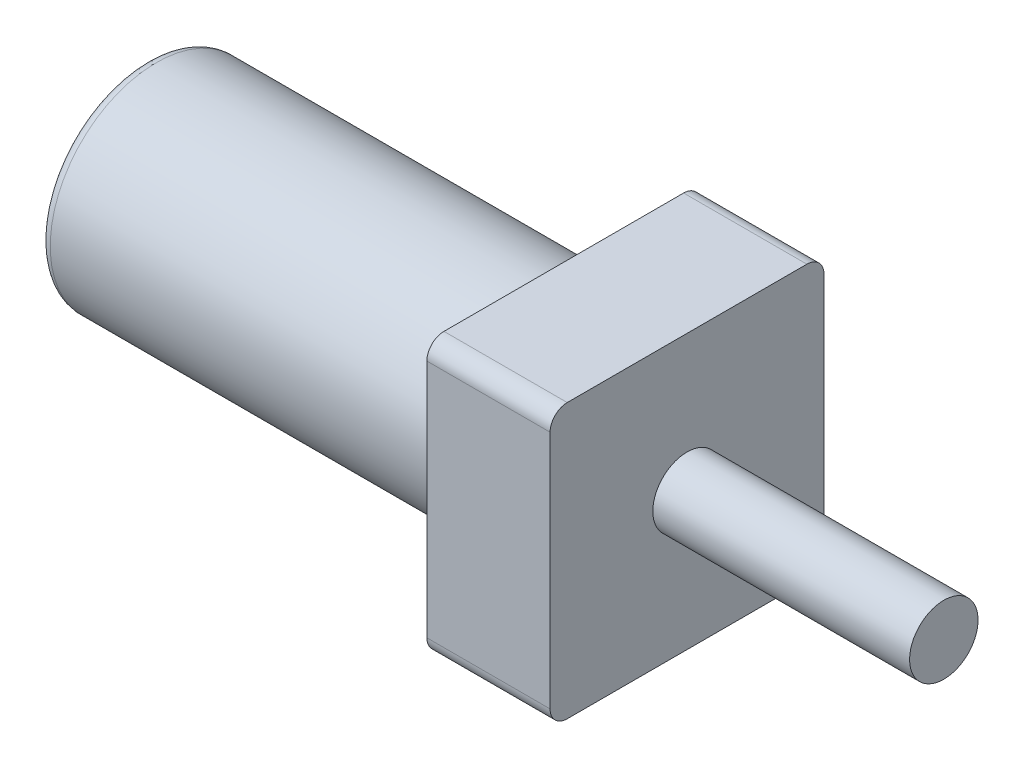
ISO-10303-21;
HEADER;
FILE_DESCRIPTION(('STEP AP214'),'2;1');
FILE_NAME('part.step','',(''),(''),'','','');
FILE_SCHEMA(('AUTOMOTIVE_DESIGN { 1 0 10303 214 1 1 1 1 }'));
ENDSEC;
DATA;
#1=APPLICATION_CONTEXT('core data for automotive mechanical design processes');
#2=APPLICATION_PROTOCOL_DEFINITION('international standard','automotive_design',2000,#1);
#3=PRODUCT_CONTEXT('',#1,'mechanical');
#4=PRODUCT('Part','Part','',(#3));
#5=PRODUCT_RELATED_PRODUCT_CATEGORY('part','',(#4));
#6=PRODUCT_DEFINITION_FORMATION('','',#4);
#7=PRODUCT_DEFINITION_CONTEXT('part definition',#1,'design');
#8=PRODUCT_DEFINITION('design','',#6,#7);
#9=PRODUCT_DEFINITION_SHAPE('','',#8);
#10=(LENGTH_UNIT() NAMED_UNIT(*) SI_UNIT(.MILLI.,.METRE.));
#11=(NAMED_UNIT(*) PLANE_ANGLE_UNIT() SI_UNIT($,.RADIAN.));
#12=(NAMED_UNIT(*) SI_UNIT($,.STERADIAN.) SOLID_ANGLE_UNIT());
#13=UNCERTAINTY_MEASURE_WITH_UNIT(LENGTH_MEASURE(1.E-05),#10,'distance_accuracy_value','');
#14=(GEOMETRIC_REPRESENTATION_CONTEXT(3) GLOBAL_UNCERTAINTY_ASSIGNED_CONTEXT((#13)) GLOBAL_UNIT_ASSIGNED_CONTEXT((#10,
#11,#12)) REPRESENTATION_CONTEXT('',''));
#15=CARTESIAN_POINT('',(0.,0.,0.));
#16=DIRECTION('',(0.,0.,1.));
#17=DIRECTION('',(1.,0.,0.));
#18=AXIS2_PLACEMENT_3D('',#15,#16,#17);
#19=CARTESIAN_POINT('',(0.,0.,0.));
#20=DIRECTION('',(1.,0.,0.));
#21=DIRECTION('',(0.,0.,-1.));
#22=AXIS2_PLACEMENT_3D('',#19,#20,#21);
#23=PLANE('',#22);
#24=CARTESIAN_POINT('',(0.,0.,0.));
#25=DIRECTION('',(1.,0.,0.));
#26=DIRECTION('',(0.,0.,-1.));
#27=AXIS2_PLACEMENT_3D('',#24,#25,#26);
#28=CIRCLE('',#27,35.56);
#29=CARTESIAN_POINT('',(0.,0.,-35.56));
#30=VERTEX_POINT('',#29);
#31=EDGE_CURVE('E41',#30,#30,#28,.F.);
#32=ORIENTED_EDGE('',*,*,#31,.T.);
#33=EDGE_LOOP('',(#32));
#34=FACE_BOUND('',#33,.T.);
#35=ADVANCED_FACE('F33',(#34),#23,.F.);
#36=CARTESIAN_POINT('',(-49.7114285714286,0.,0.));
#37=DIRECTION('',(-1.,0.,0.));
#38=DIRECTION('',(0.,0.,1.));
#39=AXIS2_PLACEMENT_3D('',#36,#37,#38);
#40=CYLINDRICAL_SURFACE('',#39,39.37);
#41=CARTESIAN_POINT('',(3.81,0.,0.));
#42=DIRECTION('',(1.,0.,0.));
#43=DIRECTION('',(0.,0.,-1.));
#44=AXIS2_PLACEMENT_3D('',#41,#42,#43);
#45=CIRCLE('',#44,39.37);
#46=CARTESIAN_POINT('',(3.81,0.,-39.37));
#47=VERTEX_POINT('',#46);
#48=EDGE_CURVE('E11',#47,#47,#45,.T.);
#49=ORIENTED_EDGE('',*,*,#48,.T.);
#50=EDGE_LOOP('',(#49));
#51=FACE_BOUND('',#50,.T.);
#52=CARTESIAN_POINT('',(154.94,0.,0.));
#53=DIRECTION('',(1.,0.,0.));
#54=DIRECTION('',(0.,0.,-1.));
#55=AXIS2_PLACEMENT_3D('',#52,#53,#54);
#56=CIRCLE('',#55,39.37);
#57=CARTESIAN_POINT('',(154.94,0.,-39.37));
#58=VERTEX_POINT('',#57);
#59=EDGE_CURVE('E137',#58,#58,#56,.T.);
#60=ORIENTED_EDGE('',*,*,#59,.F.);
#61=EDGE_LOOP('',(#60));
#62=FACE_BOUND('',#61,.T.);
#63=ADVANCED_FACE('F184',(#51,#62),#40,.T.);
#64=CARTESIAN_POINT('',(200.66,50.8,50.8));
#65=DIRECTION('',(0.,0.,-1.));
#66=DIRECTION('',(0.,1.,0.));
#67=AXIS2_PLACEMENT_3D('',#64,#65,#66);
#68=PLANE('',#67);
#69=DIRECTION('',(0.,-1.,0.));
#70=VECTOR('',#69,1.);
#71=CARTESIAN_POINT('',(154.94,50.8,50.8));
#72=LINE('',#71,#70);
#73=CARTESIAN_POINT('',(154.94,44.45,50.8));
#74=VERTEX_POINT('',#73);
#75=CARTESIAN_POINT('',(154.94,-44.45,50.8));
#76=VERTEX_POINT('',#75);
#77=EDGE_CURVE('E127',#74,#76,#72,.T.);
#78=ORIENTED_EDGE('',*,*,#77,.T.);
#79=DIRECTION('',(-1.,0.,0.));
#80=VECTOR('',#79,1.);
#81=CARTESIAN_POINT('',(200.66,-44.45,50.8));
#82=LINE('',#81,#80);
#83=CARTESIAN_POINT('',(200.66,-44.45,50.8));
#84=VERTEX_POINT('',#83);
#85=EDGE_CURVE('E105',#76,#84,#82,.F.);
#86=ORIENTED_EDGE('',*,*,#85,.T.);
#87=DIRECTION('',(0.,-1.,0.));
#88=VECTOR('',#87,1.);
#89=CARTESIAN_POINT('',(200.66,50.8,50.8));
#90=LINE('',#89,#88);
#91=CARTESIAN_POINT('',(200.66,44.45,50.8));
#92=VERTEX_POINT('',#91);
#93=EDGE_CURVE('E136',#92,#84,#90,.T.);
#94=ORIENTED_EDGE('',*,*,#93,.F.);
#95=DIRECTION('',(-1.,0.,0.));
#96=VECTOR('',#95,1.);
#97=CARTESIAN_POINT('',(200.66,44.45,50.8));
#98=LINE('',#97,#96);
#99=EDGE_CURVE('E110',#92,#74,#98,.T.);
#100=ORIENTED_EDGE('',*,*,#99,.T.);
#101=EDGE_LOOP('',(#78,#86,#94,#100));
#102=FACE_BOUND('',#101,.T.);
#103=ADVANCED_FACE('F189',(#102),#68,.F.);
#104=CARTESIAN_POINT('',(200.66,-50.8,50.8));
#105=DIRECTION('',(0.,1.,0.));
#106=DIRECTION('',(0.,0.,1.));
#107=AXIS2_PLACEMENT_3D('',#104,#105,#106);
#108=PLANE('',#107);
#109=DIRECTION('',(0.,0.,-1.));
#110=VECTOR('',#109,1.);
#111=CARTESIAN_POINT('',(200.66,-50.8,50.8));
#112=LINE('',#111,#110);
#113=CARTESIAN_POINT('',(200.66,-50.8,44.45));
#114=VERTEX_POINT('',#113);
#115=CARTESIAN_POINT('',(200.66,-50.8,-44.45));
#116=VERTEX_POINT('',#115);
#117=EDGE_CURVE('E120',#114,#116,#112,.T.);
#118=ORIENTED_EDGE('',*,*,#117,.F.);
#119=DIRECTION('',(-1.,0.,0.));
#120=VECTOR('',#119,1.);
#121=CARTESIAN_POINT('',(200.66,-50.8,44.45));
#122=LINE('',#121,#120);
#123=CARTESIAN_POINT('',(154.94,-50.8,44.45));
#124=VERTEX_POINT('',#123);
#125=EDGE_CURVE('E104',#114,#124,#122,.T.);
#126=ORIENTED_EDGE('',*,*,#125,.T.);
#127=DIRECTION('',(0.,0.,-1.));
#128=VECTOR('',#127,1.);
#129=CARTESIAN_POINT('',(154.94,-50.8,50.8));
#130=LINE('',#129,#128);
#131=CARTESIAN_POINT('',(154.94,-50.8,-44.45));
#132=VERTEX_POINT('',#131);
#133=EDGE_CURVE('E117',#124,#132,#130,.T.);
#134=ORIENTED_EDGE('',*,*,#133,.T.);
#135=DIRECTION('',(-1.,0.,0.));
#136=VECTOR('',#135,1.);
#137=CARTESIAN_POINT('',(200.66,-50.8,-44.45));
#138=LINE('',#137,#136);
#139=EDGE_CURVE('E122',#132,#116,#138,.F.);
#140=ORIENTED_EDGE('',*,*,#139,.T.);
#141=EDGE_LOOP('',(#118,#126,#134,#140));
#142=FACE_BOUND('',#141,.T.);
#143=ADVANCED_FACE('F116',(#142),#108,.F.);
#144=CARTESIAN_POINT('',(200.66,50.8,-50.8));
#145=DIRECTION('',(0.,0.,1.));
#146=DIRECTION('',(0.,-1.,0.));
#147=AXIS2_PLACEMENT_3D('',#144,#145,#146);
#148=PLANE('',#147);
#149=DIRECTION('',(0.,1.,0.));
#150=VECTOR('',#149,1.);
#151=CARTESIAN_POINT('',(200.66,50.8,-50.8));
#152=LINE('',#151,#150);
#153=CARTESIAN_POINT('',(200.66,-44.45,-50.8));
#154=VERTEX_POINT('',#153);
#155=CARTESIAN_POINT('',(200.66,44.45,-50.8));
#156=VERTEX_POINT('',#155);
#157=EDGE_CURVE('E215',#154,#156,#152,.T.);
#158=ORIENTED_EDGE('',*,*,#157,.F.);
#159=DIRECTION('',(-1.,0.,0.));
#160=VECTOR('',#159,1.);
#161=CARTESIAN_POINT('',(200.66,-44.45,-50.8));
#162=LINE('',#161,#160);
#163=CARTESIAN_POINT('',(154.94,-44.45,-50.8));
#164=VERTEX_POINT('',#163);
#165=EDGE_CURVE('E164',#154,#164,#162,.T.);
#166=ORIENTED_EDGE('',*,*,#165,.T.);
#167=DIRECTION('',(0.,1.,0.));
#168=VECTOR('',#167,1.);
#169=CARTESIAN_POINT('',(154.94,50.8,-50.8));
#170=LINE('',#169,#168);
#171=CARTESIAN_POINT('',(154.94,44.45,-50.8));
#172=VERTEX_POINT('',#171);
#173=EDGE_CURVE('E126',#164,#172,#170,.T.);
#174=ORIENTED_EDGE('',*,*,#173,.T.);
#175=DIRECTION('',(-1.,0.,0.));
#176=VECTOR('',#175,1.);
#177=CARTESIAN_POINT('',(200.66,44.45,-50.8));
#178=LINE('',#177,#176);
#179=EDGE_CURVE('E162',#172,#156,#178,.F.);
#180=ORIENTED_EDGE('',*,*,#179,.T.);
#181=EDGE_LOOP('',(#158,#166,#174,#180));
#182=FACE_BOUND('',#181,.T.);
#183=ADVANCED_FACE('F229',(#182),#148,.F.);
#184=CARTESIAN_POINT('',(200.66,50.8,50.8));
#185=DIRECTION('',(0.,-1.,0.));
#186=DIRECTION('',(0.,0.,-1.));
#187=AXIS2_PLACEMENT_3D('',#184,#185,#186);
#188=PLANE('',#187);
#189=DIRECTION('',(0.,0.,1.));
#190=VECTOR('',#189,1.);
#191=CARTESIAN_POINT('',(200.66,50.8,50.8));
#192=LINE('',#191,#190);
#193=CARTESIAN_POINT('',(200.66,50.8,-44.45));
#194=VERTEX_POINT('',#193);
#195=CARTESIAN_POINT('',(200.66,50.8,44.45));
#196=VERTEX_POINT('',#195);
#197=EDGE_CURVE('E141',#194,#196,#192,.T.);
#198=ORIENTED_EDGE('',*,*,#197,.F.);
#199=DIRECTION('',(-1.,0.,0.));
#200=VECTOR('',#199,1.);
#201=CARTESIAN_POINT('',(200.66,50.8,-44.45));
#202=LINE('',#201,#200);
#203=CARTESIAN_POINT('',(154.94,50.8,-44.45));
#204=VERTEX_POINT('',#203);
#205=EDGE_CURVE('E168',#194,#204,#202,.T.);
#206=ORIENTED_EDGE('',*,*,#205,.T.);
#207=DIRECTION('',(0.,0.,1.));
#208=VECTOR('',#207,1.);
#209=CARTESIAN_POINT('',(154.94,50.8,50.8));
#210=LINE('',#209,#208);
#211=CARTESIAN_POINT('',(154.94,50.8,44.45));
#212=VERTEX_POINT('',#211);
#213=EDGE_CURVE('E130',#204,#212,#210,.T.);
#214=ORIENTED_EDGE('',*,*,#213,.T.);
#215=DIRECTION('',(-1.,0.,0.));
#216=VECTOR('',#215,1.);
#217=CARTESIAN_POINT('',(200.66,50.8,44.45));
#218=LINE('',#217,#216);
#219=EDGE_CURVE('E48',#212,#196,#218,.F.);
#220=ORIENTED_EDGE('',*,*,#219,.T.);
#221=EDGE_LOOP('',(#198,#206,#214,#220));
#222=FACE_BOUND('',#221,.T.);
#223=ADVANCED_FACE('F208',(#222),#188,.F.);
#224=CARTESIAN_POINT('',(200.66,0.,0.));
#225=DIRECTION('',(1.,0.,0.));
#226=DIRECTION('',(0.,0.,-1.));
#227=AXIS2_PLACEMENT_3D('',#224,#225,#226);
#228=PLANE('',#227);
#229=CARTESIAN_POINT('',(200.66,0.,0.));
#230=DIRECTION('',(1.,0.,0.));
#231=DIRECTION('',(0.,0.,-1.));
#232=AXIS2_PLACEMENT_3D('',#229,#230,#231);
#233=CIRCLE('',#232,12.7);
#234=CARTESIAN_POINT('',(200.66,0.,-12.7));
#235=VERTEX_POINT('',#234);
#236=EDGE_CURVE('E140',#235,#235,#233,.T.);
#237=ORIENTED_EDGE('',*,*,#236,.F.);
#238=EDGE_LOOP('',(#237));
#239=FACE_BOUND('',#238,.T.);
#240=ORIENTED_EDGE('',*,*,#93,.T.);
#241=CARTESIAN_POINT('',(200.66,-44.45,44.45));
#242=DIRECTION('',(1.,0.,0.));
#243=DIRECTION('',(0.,0.,-1.));
#244=AXIS2_PLACEMENT_3D('',#241,#242,#243);
#245=CIRCLE('',#244,6.35);
#246=EDGE_CURVE('E160',#84,#114,#245,.T.);
#247=ORIENTED_EDGE('',*,*,#246,.T.);
#248=ORIENTED_EDGE('',*,*,#117,.T.);
#249=CARTESIAN_POINT('',(200.66,-44.45,-44.45));
#250=DIRECTION('',(1.,0.,0.));
#251=DIRECTION('',(0.,0.,-1.));
#252=AXIS2_PLACEMENT_3D('',#249,#250,#251);
#253=CIRCLE('',#252,6.35);
#254=EDGE_CURVE('E158',#116,#154,#253,.T.);
#255=ORIENTED_EDGE('',*,*,#254,.T.);
#256=ORIENTED_EDGE('',*,*,#157,.T.);
#257=CARTESIAN_POINT('',(200.66,44.45,-44.45));
#258=DIRECTION('',(1.,0.,0.));
#259=DIRECTION('',(0.,0.,-1.));
#260=AXIS2_PLACEMENT_3D('',#257,#258,#259);
#261=CIRCLE('',#260,6.35);
#262=EDGE_CURVE('E55',#156,#194,#261,.T.);
#263=ORIENTED_EDGE('',*,*,#262,.T.);
#264=ORIENTED_EDGE('',*,*,#197,.T.);
#265=CARTESIAN_POINT('',(200.66,44.45,44.45));
#266=DIRECTION('',(1.,0.,0.));
#267=DIRECTION('',(0.,0.,-1.));
#268=AXIS2_PLACEMENT_3D('',#265,#266,#267);
#269=CIRCLE('',#268,6.35);
#270=EDGE_CURVE('E155',#196,#92,#269,.T.);
#271=ORIENTED_EDGE('',*,*,#270,.T.);
#272=EDGE_LOOP('',(#240,#247,#248,#255,#256,#263,#264,#271));
#273=FACE_BOUND('',#272,.T.);
#274=ADVANCED_FACE('F218',(#239,#273),#228,.T.);
#275=CARTESIAN_POINT('',(154.94,0.,0.));
#276=DIRECTION('',(1.,0.,0.));
#277=DIRECTION('',(0.,0.,-1.));
#278=AXIS2_PLACEMENT_3D('',#275,#276,#277);
#279=PLANE('',#278);
#280=ORIENTED_EDGE('',*,*,#59,.T.);
#281=EDGE_LOOP('',(#280));
#282=FACE_BOUND('',#281,.T.);
#283=ORIENTED_EDGE('',*,*,#133,.F.);
#284=CARTESIAN_POINT('',(154.94,-44.45,44.45));
#285=DIRECTION('',(1.,0.,0.));
#286=DIRECTION('',(0.,0.,-1.));
#287=AXIS2_PLACEMENT_3D('',#284,#285,#286);
#288=CIRCLE('',#287,6.35);
#289=EDGE_CURVE('E100',#124,#76,#288,.F.);
#290=ORIENTED_EDGE('',*,*,#289,.T.);
#291=ORIENTED_EDGE('',*,*,#77,.F.);
#292=CARTESIAN_POINT('',(154.94,44.45,44.45));
#293=DIRECTION('',(1.,0.,0.));
#294=DIRECTION('',(0.,0.,-1.));
#295=AXIS2_PLACEMENT_3D('',#292,#293,#294);
#296=CIRCLE('',#295,6.35);
#297=EDGE_CURVE('E121',#74,#212,#296,.F.);
#298=ORIENTED_EDGE('',*,*,#297,.T.);
#299=ORIENTED_EDGE('',*,*,#213,.F.);
#300=CARTESIAN_POINT('',(154.94,44.45,-44.45));
#301=DIRECTION('',(1.,0.,0.));
#302=DIRECTION('',(0.,0.,-1.));
#303=AXIS2_PLACEMENT_3D('',#300,#301,#302);
#304=CIRCLE('',#303,6.35);
#305=EDGE_CURVE('E149',#204,#172,#304,.F.);
#306=ORIENTED_EDGE('',*,*,#305,.T.);
#307=ORIENTED_EDGE('',*,*,#173,.F.);
#308=CARTESIAN_POINT('',(154.94,-44.45,-44.45));
#309=DIRECTION('',(1.,0.,0.));
#310=DIRECTION('',(0.,0.,-1.));
#311=AXIS2_PLACEMENT_3D('',#308,#309,#310);
#312=CIRCLE('',#311,6.35);
#313=EDGE_CURVE('E111',#164,#132,#312,.F.);
#314=ORIENTED_EDGE('',*,*,#313,.T.);
#315=EDGE_LOOP('',(#283,#290,#291,#298,#299,#306,#307,#314));
#316=FACE_BOUND('',#315,.T.);
#317=ADVANCED_FACE('F124',(#282,#316),#279,.F.);
#318=CARTESIAN_POINT('',(295.91,12.7,0.));
#319=DIRECTION('',(-1.,0.,0.));
#320=DIRECTION('',(0.,0.,1.));
#321=AXIS2_PLACEMENT_3D('',#318,#319,#320);
#322=PLANE('',#321);
#323=CARTESIAN_POINT('',(295.91,0.,0.));
#324=DIRECTION('',(-1.,0.,0.));
#325=DIRECTION('',(0.,0.,1.));
#326=AXIS2_PLACEMENT_3D('',#323,#324,#325);
#327=CIRCLE('',#326,12.7);
#328=CARTESIAN_POINT('',(295.91,0.,12.7));
#329=VERTEX_POINT('',#328);
#330=EDGE_CURVE('E142',#329,#329,#327,.T.);
#331=ORIENTED_EDGE('',*,*,#330,.F.);
#332=EDGE_LOOP('',(#331));
#333=FACE_BOUND('',#332,.T.);
#334=ADVANCED_FACE('F226',(#333),#322,.F.);
#335=CARTESIAN_POINT('',(-49.7114285714286,0.,0.));
#336=DIRECTION('',(-1.,0.,0.));
#337=DIRECTION('',(0.,0.,1.));
#338=AXIS2_PLACEMENT_3D('',#335,#336,#337);
#339=CYLINDRICAL_SURFACE('',#338,12.7);
#340=ORIENTED_EDGE('',*,*,#236,.T.);
#341=EDGE_LOOP('',(#340));
#342=FACE_BOUND('',#341,.T.);
#343=ORIENTED_EDGE('',*,*,#330,.T.);
#344=EDGE_LOOP('',(#343));
#345=FACE_BOUND('',#344,.T.);
#346=ADVANCED_FACE('F197',(#342,#345),#339,.T.);
#347=CARTESIAN_POINT('',(200.66,-44.45,44.45));
#348=DIRECTION('',(-1.,0.,0.));
#349=DIRECTION('',(0.,0.,1.));
#350=AXIS2_PLACEMENT_3D('',#347,#348,#349);
#351=CYLINDRICAL_SURFACE('',#350,6.35);
#352=ORIENTED_EDGE('',*,*,#246,.F.);
#353=ORIENTED_EDGE('',*,*,#85,.F.);
#354=ORIENTED_EDGE('',*,*,#289,.F.);
#355=ORIENTED_EDGE('',*,*,#125,.F.);
#356=EDGE_LOOP('',(#352,#353,#354,#355));
#357=FACE_BOUND('',#356,.T.);
#358=ADVANCED_FACE('F103',(#357),#351,.T.);
#359=CARTESIAN_POINT('',(200.66,-44.45,-44.45));
#360=DIRECTION('',(-1.,0.,0.));
#361=DIRECTION('',(0.,0.,1.));
#362=AXIS2_PLACEMENT_3D('',#359,#360,#361);
#363=CYLINDRICAL_SURFACE('',#362,6.35);
#364=ORIENTED_EDGE('',*,*,#254,.F.);
#365=ORIENTED_EDGE('',*,*,#139,.F.);
#366=ORIENTED_EDGE('',*,*,#313,.F.);
#367=ORIENTED_EDGE('',*,*,#165,.F.);
#368=EDGE_LOOP('',(#364,#365,#366,#367));
#369=FACE_BOUND('',#368,.T.);
#370=ADVANCED_FACE('F196',(#369),#363,.T.);
#371=CARTESIAN_POINT('',(200.66,44.45,-44.45));
#372=DIRECTION('',(-1.,0.,0.));
#373=DIRECTION('',(0.,0.,1.));
#374=AXIS2_PLACEMENT_3D('',#371,#372,#373);
#375=CYLINDRICAL_SURFACE('',#374,6.35);
#376=ORIENTED_EDGE('',*,*,#262,.F.);
#377=ORIENTED_EDGE('',*,*,#179,.F.);
#378=ORIENTED_EDGE('',*,*,#305,.F.);
#379=ORIENTED_EDGE('',*,*,#205,.F.);
#380=EDGE_LOOP('',(#376,#377,#378,#379));
#381=FACE_BOUND('',#380,.T.);
#382=ADVANCED_FACE('F180',(#381),#375,.T.);
#383=CARTESIAN_POINT('',(200.66,44.45,44.45));
#384=DIRECTION('',(-1.,0.,0.));
#385=DIRECTION('',(0.,0.,1.));
#386=AXIS2_PLACEMENT_3D('',#383,#384,#385);
#387=CYLINDRICAL_SURFACE('',#386,6.35);
#388=ORIENTED_EDGE('',*,*,#270,.F.);
#389=ORIENTED_EDGE('',*,*,#219,.F.);
#390=ORIENTED_EDGE('',*,*,#297,.F.);
#391=ORIENTED_EDGE('',*,*,#99,.F.);
#392=EDGE_LOOP('',(#388,#389,#390,#391));
#393=FACE_BOUND('',#392,.T.);
#394=ADVANCED_FACE('F175',(#393),#387,.T.);
#395=CARTESIAN_POINT('',(3.81,0.,0.));
#396=DIRECTION('',(1.,0.,0.));
#397=DIRECTION('',(0.,0.,-1.));
#398=AXIS2_PLACEMENT_3D('',#395,#396,#397);
#399=TOROIDAL_SURFACE('',#398,35.56,3.81);
#400=ORIENTED_EDGE('',*,*,#48,.F.);
#401=EDGE_LOOP('',(#400));
#402=FACE_BOUND('',#401,.T.);
#403=ORIENTED_EDGE('',*,*,#31,.F.);
#404=EDGE_LOOP('',(#403));
#405=FACE_BOUND('',#404,.T.);
#406=ADVANCED_FACE('F35',(#402,#405),#399,.T.);
#407=CLOSED_SHELL('',(#35,#63,#103,#143,#183,#223,#274,#317,#334,#346,#358,#370,#382,#394,#406));
#408=MANIFOLD_SOLID_BREP('B2',#407);
#409=ADVANCED_BREP_SHAPE_REPRESENTATION('',(#18,#408),#14);
#410=SHAPE_DEFINITION_REPRESENTATION(#9,#409);
ENDSEC;
END-ISO-10303-21;
